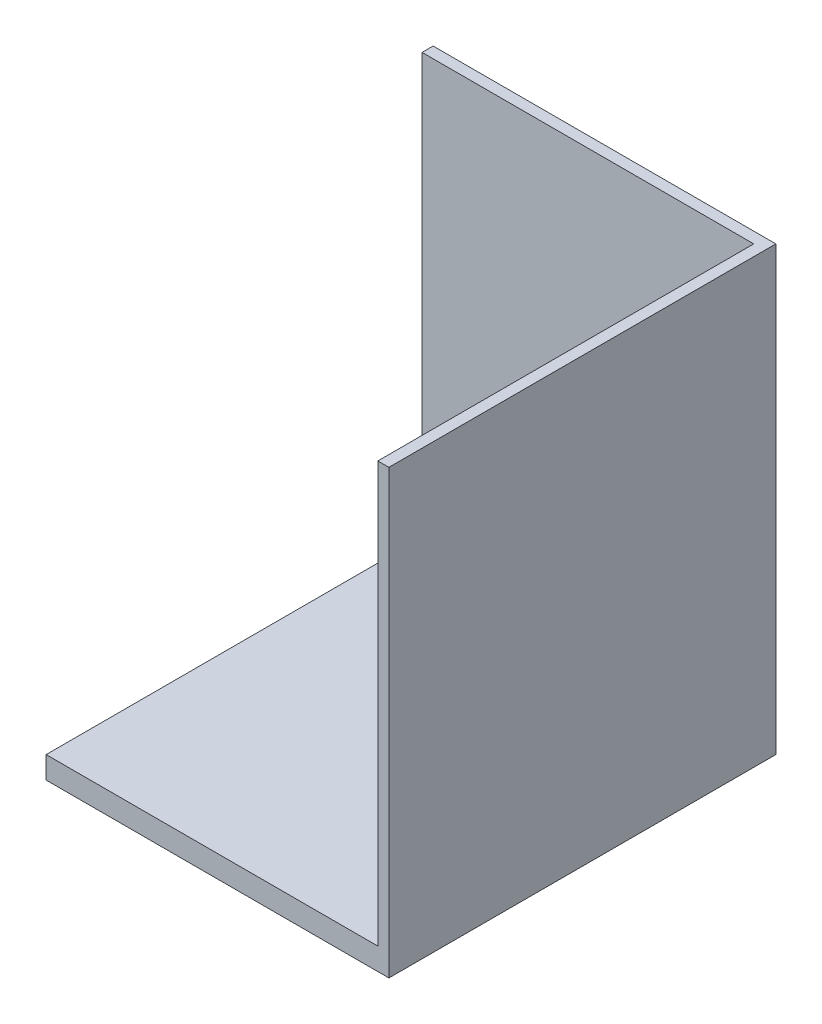
ISO-10303-21;
HEADER;
FILE_DESCRIPTION(('STEP AP214'),'2;1');
FILE_NAME('part.step','',(''),(''),'','','');
FILE_SCHEMA(('AUTOMOTIVE_DESIGN { 1 0 10303 214 1 1 1 1 }'));
ENDSEC;
DATA;
#1=APPLICATION_CONTEXT('core data for automotive mechanical design processes');
#2=APPLICATION_PROTOCOL_DEFINITION('international standard','automotive_design',2000,#1);
#3=PRODUCT_CONTEXT('',#1,'mechanical');
#4=PRODUCT('Part','Part','',(#3));
#5=PRODUCT_RELATED_PRODUCT_CATEGORY('part','',(#4));
#6=PRODUCT_DEFINITION_FORMATION('','',#4);
#7=PRODUCT_DEFINITION_CONTEXT('part definition',#1,'design');
#8=PRODUCT_DEFINITION('design','',#6,#7);
#9=PRODUCT_DEFINITION_SHAPE('','',#8);
#10=(LENGTH_UNIT() NAMED_UNIT(*) SI_UNIT(.MILLI.,.METRE.));
#11=(NAMED_UNIT(*) PLANE_ANGLE_UNIT() SI_UNIT($,.RADIAN.));
#12=(NAMED_UNIT(*) SI_UNIT($,.STERADIAN.) SOLID_ANGLE_UNIT());
#13=UNCERTAINTY_MEASURE_WITH_UNIT(LENGTH_MEASURE(1.E-05),#10,'distance_accuracy_value','');
#14=(GEOMETRIC_REPRESENTATION_CONTEXT(3) GLOBAL_UNCERTAINTY_ASSIGNED_CONTEXT((#13)) GLOBAL_UNIT_ASSIGNED_CONTEXT((#10,
#11,#12)) REPRESENTATION_CONTEXT('',''));
#15=CARTESIAN_POINT('',(0.,0.,0.));
#16=DIRECTION('',(0.,0.,1.));
#17=DIRECTION('',(1.,0.,0.));
#18=AXIS2_PLACEMENT_3D('',#15,#16,#17);
#19=CARTESIAN_POINT('',(65.2173913043479,-43.2608695652173,-200.));
#20=DIRECTION('',(0.,-1.,0.));
#21=DIRECTION('',(1.,0.,0.));
#22=AXIS2_PLACEMENT_3D('',#19,#20,#21);
#23=PLANE('',#22);
#24=DIRECTION('',(1.,0.,0.));
#25=VECTOR('',#24,1.);
#26=CARTESIAN_POINT('',(65.2173913043479,-43.2608695652173,-30.));
#27=LINE('',#26,#25);
#28=CARTESIAN_POINT('',(-84.7826086956521,-43.2608695652174,-30.));
#29=VERTEX_POINT('',#28);
#30=CARTESIAN_POINT('',(70.2173913043479,-43.2608695652173,-30.));
#31=VERTEX_POINT('',#30);
#32=EDGE_CURVE('E189',#29,#31,#27,.T.);
#33=ORIENTED_EDGE('',*,*,#32,.F.);
#34=DIRECTION('',(0.,0.,1.));
#35=VECTOR('',#34,1.);
#36=CARTESIAN_POINT('',(-84.7826086956521,-43.2608695652174,-200.));
#37=LINE('',#36,#35);
#38=CARTESIAN_POINT('',(-84.7826086956521,-43.2608695652174,-160.));
#39=VERTEX_POINT('',#38);
#40=EDGE_CURVE('E172',#39,#29,#37,.T.);
#41=ORIENTED_EDGE('',*,*,#40,.F.);
#42=DIRECTION('',(1.,0.,0.));
#43=VECTOR('',#42,1.);
#44=CARTESIAN_POINT('',(0.,-43.2608695652174,-160.));
#45=LINE('',#44,#43);
#46=CARTESIAN_POINT('',(25.2173913043479,-43.2608695652173,-160.));
#47=VERTEX_POINT('',#46);
#48=EDGE_CURVE('E188',#39,#47,#45,.T.);
#49=ORIENTED_EDGE('',*,*,#48,.T.);
#50=DIRECTION('',(0.,0.,1.));
#51=VECTOR('',#50,1.);
#52=CARTESIAN_POINT('',(25.2173913043479,-43.2608695652173,0.));
#53=LINE('',#52,#51);
#54=CARTESIAN_POINT('',(25.2173913043479,-43.2608695652173,-60.));
#55=VERTEX_POINT('',#54);
#56=EDGE_CURVE('E224',#47,#55,#53,.T.);
#57=ORIENTED_EDGE('',*,*,#56,.T.);
#58=DIRECTION('',(1.,0.,0.));
#59=VECTOR('',#58,1.);
#60=CARTESIAN_POINT('',(0.,-43.2608695652174,-60.));
#61=LINE('',#60,#59);
#62=CARTESIAN_POINT('',(35.2173913043479,-43.2608695652173,-60.));
#63=VERTEX_POINT('',#62);
#64=EDGE_CURVE('E221',#55,#63,#61,.T.);
#65=ORIENTED_EDGE('',*,*,#64,.T.);
#66=DIRECTION('',(0.,0.,-1.));
#67=VECTOR('',#66,1.);
#68=CARTESIAN_POINT('',(35.2173913043479,-43.2608695652173,0.));
#69=LINE('',#68,#67);
#70=CARTESIAN_POINT('',(35.2173913043479,-43.2608695652173,-170.));
#71=VERTEX_POINT('',#70);
#72=EDGE_CURVE('E195',#63,#71,#69,.T.);
#73=ORIENTED_EDGE('',*,*,#72,.T.);
#74=DIRECTION('',(-1.,0.,0.));
#75=VECTOR('',#74,1.);
#76=CARTESIAN_POINT('',(0.,-43.2608695652174,-170.));
#77=LINE('',#76,#75);
#78=CARTESIAN_POINT('',(-84.7826086956521,-43.2608695652174,-170.));
#79=VERTEX_POINT('',#78);
#80=EDGE_CURVE('E60',#71,#79,#77,.T.);
#81=ORIENTED_EDGE('',*,*,#80,.T.);
#82=CARTESIAN_POINT('',(-84.7826086956521,-43.2608695652173,-205.));
#83=VERTEX_POINT('',#82);
#84=EDGE_CURVE('E177',#83,#79,#37,.T.);
#85=ORIENTED_EDGE('',*,*,#84,.F.);
#86=DIRECTION('',(1.,0.,0.));
#87=VECTOR('',#86,1.);
#88=CARTESIAN_POINT('',(65.2173913043479,-43.2608695652173,-205.));
#89=LINE('',#88,#87);
#90=CARTESIAN_POINT('',(70.2173913043479,-43.2608695652173,-205.));
#91=VERTEX_POINT('',#90);
#92=EDGE_CURVE('E154',#83,#91,#89,.T.);
#93=ORIENTED_EDGE('',*,*,#92,.T.);
#94=DIRECTION('',(0.,0.,1.));
#95=VECTOR('',#94,1.);
#96=CARTESIAN_POINT('',(70.2173913043479,-43.2608695652173,-205.));
#97=LINE('',#96,#95);
#98=EDGE_CURVE('E166',#91,#31,#97,.T.);
#99=ORIENTED_EDGE('',*,*,#98,.T.);
#100=EDGE_LOOP('',(#33,#41,#49,#57,#65,#73,#81,#85,#93,#99));
#101=FACE_BOUND('',#100,.T.);
#102=ADVANCED_FACE('F38',(#101),#23,.T.);
#103=CARTESIAN_POINT('',(-84.7826086956521,-43.2608695652174,-200.));
#104=DIRECTION('',(-1.,0.,0.));
#105=DIRECTION('',(0.,0.,1.));
#106=AXIS2_PLACEMENT_3D('',#103,#104,#105);
#107=PLANE('',#106);
#108=DIRECTION('',(0.,-1.,0.));
#109=VECTOR('',#108,1.);
#110=CARTESIAN_POINT('',(-84.7826086956521,0.,-30.));
#111=LINE('',#110,#109);
#112=CARTESIAN_POINT('',(-84.7826086956521,-33.2608695652174,-30.));
#113=VERTEX_POINT('',#112);
#114=EDGE_CURVE('E149',#113,#29,#111,.T.);
#115=ORIENTED_EDGE('',*,*,#114,.F.);
#116=DIRECTION('',(0.,0.,1.));
#117=VECTOR('',#116,1.);
#118=CARTESIAN_POINT('',(-84.7826086956521,-33.2608695652174,-200.));
#119=LINE('',#118,#117);
#120=CARTESIAN_POINT('',(-84.7826086956521,-33.2608695652174,-200.));
#121=VERTEX_POINT('',#120);
#122=EDGE_CURVE('E46',#121,#113,#119,.T.);
#123=ORIENTED_EDGE('',*,*,#122,.F.);
#124=DIRECTION('',(0.,1.,0.));
#125=VECTOR('',#124,1.);
#126=CARTESIAN_POINT('',(-84.7826086956521,-43.2608695652173,-200.));
#127=LINE('',#126,#125);
#128=CARTESIAN_POINT('',(-84.7826086956521,156.739130434783,-200.));
#129=VERTEX_POINT('',#128);
#130=EDGE_CURVE('E148',#121,#129,#127,.T.);
#131=ORIENTED_EDGE('',*,*,#130,.T.);
#132=DIRECTION('',(0.,0.,1.));
#133=VECTOR('',#132,1.);
#134=CARTESIAN_POINT('',(-84.7826086956521,156.739130434783,0.));
#135=LINE('',#134,#133);
#136=CARTESIAN_POINT('',(-84.7826086956521,156.739130434783,-205.));
#137=VERTEX_POINT('',#136);
#138=EDGE_CURVE('E52',#137,#129,#135,.T.);
#139=ORIENTED_EDGE('',*,*,#138,.F.);
#140=DIRECTION('',(0.,-1.,0.));
#141=VECTOR('',#140,1.);
#142=CARTESIAN_POINT('',(-84.7826086956521,256.739130434783,-205.));
#143=LINE('',#142,#141);
#144=EDGE_CURVE('E145',#137,#83,#143,.T.);
#145=ORIENTED_EDGE('',*,*,#144,.T.);
#146=ORIENTED_EDGE('',*,*,#84,.T.);
#147=DIRECTION('',(0.,1.,0.));
#148=VECTOR('',#147,1.);
#149=CARTESIAN_POINT('',(-84.7826086956521,-73.2608695652174,-170.));
#150=LINE('',#149,#148);
#151=CARTESIAN_POINT('',(-84.7826086956521,-73.2608695652174,-170.));
#152=VERTEX_POINT('',#151);
#153=EDGE_CURVE('E217',#152,#79,#150,.T.);
#154=ORIENTED_EDGE('',*,*,#153,.F.);
#155=DIRECTION('',(0.,0.,-1.));
#156=VECTOR('',#155,1.);
#157=CARTESIAN_POINT('',(-84.7826086956521,-73.2608695652174,0.));
#158=LINE('',#157,#156);
#159=CARTESIAN_POINT('',(-84.7826086956521,-73.2608695652174,-160.));
#160=VERTEX_POINT('',#159);
#161=EDGE_CURVE('E216',#160,#152,#158,.T.);
#162=ORIENTED_EDGE('',*,*,#161,.F.);
#163=DIRECTION('',(0.,1.,0.));
#164=VECTOR('',#163,1.);
#165=CARTESIAN_POINT('',(-84.7826086956521,-73.2608695652174,-160.));
#166=LINE('',#165,#164);
#167=EDGE_CURVE('E182',#160,#39,#166,.T.);
#168=ORIENTED_EDGE('',*,*,#167,.T.);
#169=ORIENTED_EDGE('',*,*,#40,.T.);
#170=EDGE_LOOP('',(#115,#123,#131,#139,#145,#146,#154,#162,#168,#169));
#171=FACE_BOUND('',#170,.T.);
#172=ADVANCED_FACE('F40',(#171),#107,.T.);
#173=CARTESIAN_POINT('',(-84.7826086956521,-33.2608695652174,-200.));
#174=DIRECTION('',(0.,1.,0.));
#175=DIRECTION('',(0.,0.,1.));
#176=AXIS2_PLACEMENT_3D('',#173,#174,#175);
#177=PLANE('',#176);
#178=DIRECTION('',(-1.,0.,0.));
#179=VECTOR('',#178,1.);
#180=CARTESIAN_POINT('',(-84.7826086956521,-33.2608695652174,-30.));
#181=LINE('',#180,#179);
#182=CARTESIAN_POINT('',(65.2173913043479,-33.2608695652174,-30.));
#183=VERTEX_POINT('',#182);
#184=EDGE_CURVE('E193',#183,#113,#181,.T.);
#185=ORIENTED_EDGE('',*,*,#184,.F.);
#186=DIRECTION('',(0.,0.,1.));
#187=VECTOR('',#186,1.);
#188=CARTESIAN_POINT('',(65.2173913043479,-33.2608695652174,-200.));
#189=LINE('',#188,#187);
#190=CARTESIAN_POINT('',(65.2173913043479,-33.2608695652174,-200.));
#191=VERTEX_POINT('',#190);
#192=EDGE_CURVE('E175',#191,#183,#189,.T.);
#193=ORIENTED_EDGE('',*,*,#192,.F.);
#194=DIRECTION('',(-1.,0.,0.));
#195=VECTOR('',#194,1.);
#196=CARTESIAN_POINT('',(-84.7826086956521,-33.2608695652174,-200.));
#197=LINE('',#196,#195);
#198=EDGE_CURVE('E169',#191,#121,#197,.T.);
#199=ORIENTED_EDGE('',*,*,#198,.T.);
#200=ORIENTED_EDGE('',*,*,#122,.T.);
#201=EDGE_LOOP('',(#185,#193,#199,#200));
#202=FACE_BOUND('',#201,.T.);
#203=ADVANCED_FACE('F265',(#202),#177,.T.);
#204=CARTESIAN_POINT('',(65.2173913043479,256.739130434783,-205.));
#205=DIRECTION('',(-1.,0.,0.));
#206=DIRECTION('',(0.,0.,1.));
#207=AXIS2_PLACEMENT_3D('',#204,#205,#206);
#208=PLANE('',#207);
#209=DIRECTION('',(0.,-1.,0.));
#210=VECTOR('',#209,1.);
#211=CARTESIAN_POINT('',(65.2173913043479,256.739130434783,-30.));
#212=LINE('',#211,#210);
#213=CARTESIAN_POINT('',(65.2173913043479,156.739130434783,-30.));
#214=VERTEX_POINT('',#213);
#215=EDGE_CURVE('E197',#214,#183,#212,.T.);
#216=ORIENTED_EDGE('',*,*,#215,.F.);
#217=DIRECTION('',(0.,0.,1.));
#218=VECTOR('',#217,1.);
#219=CARTESIAN_POINT('',(65.2173913043479,156.739130434783,-205.));
#220=LINE('',#219,#218);
#221=CARTESIAN_POINT('',(65.2173913043479,156.739130434783,-200.));
#222=VERTEX_POINT('',#221);
#223=EDGE_CURVE('E406',#222,#214,#220,.T.);
#224=ORIENTED_EDGE('',*,*,#223,.F.);
#225=DIRECTION('',(0.,1.,0.));
#226=VECTOR('',#225,1.);
#227=CARTESIAN_POINT('',(65.2173913043479,-43.2608695652173,-200.));
#228=LINE('',#227,#226);
#229=EDGE_CURVE('E157',#191,#222,#228,.T.);
#230=ORIENTED_EDGE('',*,*,#229,.F.);
#231=ORIENTED_EDGE('',*,*,#192,.T.);
#232=EDGE_LOOP('',(#216,#224,#230,#231));
#233=FACE_BOUND('',#232,.T.);
#234=ADVANCED_FACE('F269',(#233),#208,.T.);
#235=CARTESIAN_POINT('',(70.2173913043479,-43.2608695652173,-205.));
#236=DIRECTION('',(1.,0.,0.));
#237=DIRECTION('',(0.,1.,0.));
#238=AXIS2_PLACEMENT_3D('',#235,#236,#237);
#239=PLANE('',#238);
#240=DIRECTION('',(0.,-1.,0.));
#241=VECTOR('',#240,1.);
#242=CARTESIAN_POINT('',(70.2173913043479,0.,-30.));
#243=LINE('',#242,#241);
#244=CARTESIAN_POINT('',(70.2173913043479,156.739130434783,-30.));
#245=VERTEX_POINT('',#244);
#246=EDGE_CURVE('E139',#245,#31,#243,.T.);
#247=ORIENTED_EDGE('',*,*,#246,.T.);
#248=ORIENTED_EDGE('',*,*,#98,.F.);
#249=DIRECTION('',(0.,1.,0.));
#250=VECTOR('',#249,1.);
#251=CARTESIAN_POINT('',(70.2173913043479,-43.2608695652173,-205.));
#252=LINE('',#251,#250);
#253=CARTESIAN_POINT('',(70.2173913043479,156.739130434783,-205.));
#254=VERTEX_POINT('',#253);
#255=EDGE_CURVE('E164',#91,#254,#252,.T.);
#256=ORIENTED_EDGE('',*,*,#255,.T.);
#257=DIRECTION('',(0.,0.,1.));
#258=VECTOR('',#257,1.);
#259=CARTESIAN_POINT('',(70.2173913043479,156.739130434783,0.));
#260=LINE('',#259,#258);
#261=EDGE_CURVE('E133',#254,#245,#260,.T.);
#262=ORIENTED_EDGE('',*,*,#261,.T.);
#263=EDGE_LOOP('',(#247,#248,#256,#262));
#264=FACE_BOUND('',#263,.T.);
#265=ADVANCED_FACE('F271',(#264),#239,.T.);
#266=CARTESIAN_POINT('',(0.,0.,-205.));
#267=DIRECTION('',(0.,0.,1.));
#268=DIRECTION('',(1.,0.,0.));
#269=AXIS2_PLACEMENT_3D('',#266,#267,#268);
#270=PLANE('',#269);
#271=ORIENTED_EDGE('',*,*,#144,.F.);
#272=DIRECTION('',(-1.,0.,0.));
#273=VECTOR('',#272,1.);
#274=CARTESIAN_POINT('',(70.2173913043479,156.739130434783,-205.));
#275=LINE('',#274,#273);
#276=EDGE_CURVE('E130',#254,#137,#275,.T.);
#277=ORIENTED_EDGE('',*,*,#276,.F.);
#278=ORIENTED_EDGE('',*,*,#255,.F.);
#279=ORIENTED_EDGE('',*,*,#92,.F.);
#280=EDGE_LOOP('',(#271,#277,#278,#279));
#281=FACE_BOUND('',#280,.T.);
#282=ADVANCED_FACE('F152',(#281),#270,.F.);
#283=CARTESIAN_POINT('',(65.2173913043479,-43.2608695652173,-200.));
#284=DIRECTION('',(0.,0.,1.));
#285=DIRECTION('',(1.,0.,0.));
#286=AXIS2_PLACEMENT_3D('',#283,#284,#285);
#287=PLANE('',#286);
#288=DIRECTION('',(1.,0.,0.));
#289=VECTOR('',#288,1.);
#290=CARTESIAN_POINT('',(65.2173913043479,156.739130434783,-200.));
#291=LINE('',#290,#289);
#292=EDGE_CURVE('E11',#129,#222,#291,.T.);
#293=ORIENTED_EDGE('',*,*,#292,.F.);
#294=ORIENTED_EDGE('',*,*,#130,.F.);
#295=ORIENTED_EDGE('',*,*,#198,.F.);
#296=ORIENTED_EDGE('',*,*,#229,.T.);
#297=EDGE_LOOP('',(#293,#294,#295,#296));
#298=FACE_BOUND('',#297,.T.);
#299=ADVANCED_FACE('F280',(#298),#287,.T.);
#300=CARTESIAN_POINT('',(0.,-73.2608695652173,-170.));
#301=DIRECTION('',(0.,0.,-1.));
#302=DIRECTION('',(-1.,0.,0.));
#303=AXIS2_PLACEMENT_3D('',#300,#301,#302);
#304=PLANE('',#303);
#305=ORIENTED_EDGE('',*,*,#80,.F.);
#306=DIRECTION('',(0.,1.,0.));
#307=VECTOR('',#306,1.);
#308=CARTESIAN_POINT('',(35.2173913043479,-73.2608695652173,-170.));
#309=LINE('',#308,#307);
#310=CARTESIAN_POINT('',(35.2173913043479,-73.2608695652173,-170.));
#311=VERTEX_POINT('',#310);
#312=EDGE_CURVE('E155',#311,#71,#309,.T.);
#313=ORIENTED_EDGE('',*,*,#312,.F.);
#314=DIRECTION('',(-1.,0.,0.));
#315=VECTOR('',#314,1.);
#316=CARTESIAN_POINT('',(0.,-73.2608695652173,-170.));
#317=LINE('',#316,#315);
#318=EDGE_CURVE('E201',#311,#152,#317,.T.);
#319=ORIENTED_EDGE('',*,*,#318,.T.);
#320=ORIENTED_EDGE('',*,*,#153,.T.);
#321=EDGE_LOOP('',(#305,#313,#319,#320));
#322=FACE_BOUND('',#321,.T.);
#323=ADVANCED_FACE('F249',(#322),#304,.T.);
#324=CARTESIAN_POINT('',(35.2173913043479,-73.2608695652173,0.));
#325=DIRECTION('',(1.,0.,0.));
#326=DIRECTION('',(0.,1.,0.));
#327=AXIS2_PLACEMENT_3D('',#324,#325,#326);
#328=PLANE('',#327);
#329=ORIENTED_EDGE('',*,*,#72,.F.);
#330=DIRECTION('',(0.,1.,0.));
#331=VECTOR('',#330,1.);
#332=CARTESIAN_POINT('',(35.2173913043479,-73.2608695652173,-60.));
#333=LINE('',#332,#331);
#334=CARTESIAN_POINT('',(35.2173913043479,-73.2608695652173,-60.));
#335=VERTEX_POINT('',#334);
#336=EDGE_CURVE('E159',#335,#63,#333,.T.);
#337=ORIENTED_EDGE('',*,*,#336,.F.);
#338=DIRECTION('',(0.,0.,-1.));
#339=VECTOR('',#338,1.);
#340=CARTESIAN_POINT('',(35.2173913043479,-73.2608695652173,0.));
#341=LINE('',#340,#339);
#342=EDGE_CURVE('E204',#335,#311,#341,.T.);
#343=ORIENTED_EDGE('',*,*,#342,.T.);
#344=ORIENTED_EDGE('',*,*,#312,.T.);
#345=EDGE_LOOP('',(#329,#337,#343,#344));
#346=FACE_BOUND('',#345,.T.);
#347=ADVANCED_FACE('F240',(#346),#328,.T.);
#348=CARTESIAN_POINT('',(0.,-73.2608695652173,-60.));
#349=DIRECTION('',(0.,0.,1.));
#350=DIRECTION('',(1.,0.,0.));
#351=AXIS2_PLACEMENT_3D('',#348,#349,#350);
#352=PLANE('',#351);
#353=ORIENTED_EDGE('',*,*,#64,.F.);
#354=DIRECTION('',(0.,1.,0.));
#355=VECTOR('',#354,1.);
#356=CARTESIAN_POINT('',(25.2173913043479,-73.2608695652173,-60.));
#357=LINE('',#356,#355);
#358=CARTESIAN_POINT('',(25.2173913043479,-73.2608695652173,-60.));
#359=VERTEX_POINT('',#358);
#360=EDGE_CURVE('E231',#359,#55,#357,.T.);
#361=ORIENTED_EDGE('',*,*,#360,.F.);
#362=DIRECTION('',(1.,0.,0.));
#363=VECTOR('',#362,1.);
#364=CARTESIAN_POINT('',(0.,-73.2608695652173,-60.));
#365=LINE('',#364,#363);
#366=EDGE_CURVE('E207',#359,#335,#365,.T.);
#367=ORIENTED_EDGE('',*,*,#366,.T.);
#368=ORIENTED_EDGE('',*,*,#336,.T.);
#369=EDGE_LOOP('',(#353,#361,#367,#368));
#370=FACE_BOUND('',#369,.T.);
#371=ADVANCED_FACE('F236',(#370),#352,.T.);
#372=CARTESIAN_POINT('',(25.2173913043479,-73.2608695652173,0.));
#373=DIRECTION('',(-1.,0.,0.));
#374=DIRECTION('',(0.,-1.,0.));
#375=AXIS2_PLACEMENT_3D('',#372,#373,#374);
#376=PLANE('',#375);
#377=ORIENTED_EDGE('',*,*,#56,.F.);
#378=DIRECTION('',(0.,1.,0.));
#379=VECTOR('',#378,1.);
#380=CARTESIAN_POINT('',(25.2173913043479,-73.2608695652173,-160.));
#381=LINE('',#380,#379);
#382=CARTESIAN_POINT('',(25.2173913043479,-73.2608695652173,-160.));
#383=VERTEX_POINT('',#382);
#384=EDGE_CURVE('E229',#383,#47,#381,.T.);
#385=ORIENTED_EDGE('',*,*,#384,.F.);
#386=DIRECTION('',(0.,0.,1.));
#387=VECTOR('',#386,1.);
#388=CARTESIAN_POINT('',(25.2173913043479,-73.2608695652173,0.));
#389=LINE('',#388,#387);
#390=EDGE_CURVE('E210',#383,#359,#389,.T.);
#391=ORIENTED_EDGE('',*,*,#390,.T.);
#392=ORIENTED_EDGE('',*,*,#360,.T.);
#393=EDGE_LOOP('',(#377,#385,#391,#392));
#394=FACE_BOUND('',#393,.T.);
#395=ADVANCED_FACE('F243',(#394),#376,.T.);
#396=CARTESIAN_POINT('',(0.,-73.2608695652173,-160.));
#397=DIRECTION('',(0.,0.,1.));
#398=DIRECTION('',(1.,0.,0.));
#399=AXIS2_PLACEMENT_3D('',#396,#397,#398);
#400=PLANE('',#399);
#401=ORIENTED_EDGE('',*,*,#48,.F.);
#402=ORIENTED_EDGE('',*,*,#167,.F.);
#403=DIRECTION('',(1.,0.,0.));
#404=VECTOR('',#403,1.);
#405=CARTESIAN_POINT('',(0.,-73.2608695652173,-160.));
#406=LINE('',#405,#404);
#407=EDGE_CURVE('E213',#160,#383,#406,.T.);
#408=ORIENTED_EDGE('',*,*,#407,.T.);
#409=ORIENTED_EDGE('',*,*,#384,.T.);
#410=EDGE_LOOP('',(#401,#402,#408,#409));
#411=FACE_BOUND('',#410,.T.);
#412=ADVANCED_FACE('F251',(#411),#400,.T.);
#413=CARTESIAN_POINT('',(0.,-73.2608695652173,0.));
#414=DIRECTION('',(0.,-1.,0.));
#415=DIRECTION('',(1.,0.,0.));
#416=AXIS2_PLACEMENT_3D('',#413,#414,#415);
#417=PLANE('',#416);
#418=ORIENTED_EDGE('',*,*,#318,.F.);
#419=ORIENTED_EDGE('',*,*,#342,.F.);
#420=ORIENTED_EDGE('',*,*,#366,.F.);
#421=ORIENTED_EDGE('',*,*,#390,.F.);
#422=ORIENTED_EDGE('',*,*,#407,.F.);
#423=ORIENTED_EDGE('',*,*,#161,.T.);
#424=EDGE_LOOP('',(#418,#419,#420,#421,#422,#423));
#425=FACE_BOUND('',#424,.T.);
#426=ADVANCED_FACE('F247',(#425),#417,.T.);
#427=CARTESIAN_POINT('',(70.2173913043479,0.,-30.));
#428=DIRECTION('',(0.,0.,-1.));
#429=DIRECTION('',(0.,1.,0.));
#430=AXIS2_PLACEMENT_3D('',#427,#428,#429);
#431=PLANE('',#430);
#432=ORIENTED_EDGE('',*,*,#32,.T.);
#433=ORIENTED_EDGE('',*,*,#246,.F.);
#434=DIRECTION('',(-1.,0.,0.));
#435=VECTOR('',#434,1.);
#436=CARTESIAN_POINT('',(70.2173913043479,156.739130434783,-30.));
#437=LINE('',#436,#435);
#438=EDGE_CURVE('E138',#245,#214,#437,.T.);
#439=ORIENTED_EDGE('',*,*,#438,.T.);
#440=ORIENTED_EDGE('',*,*,#215,.T.);
#441=ORIENTED_EDGE('',*,*,#184,.T.);
#442=ORIENTED_EDGE('',*,*,#114,.T.);
#443=EDGE_LOOP('',(#432,#433,#439,#440,#441,#442));
#444=FACE_BOUND('',#443,.T.);
#445=ADVANCED_FACE('F258',(#444),#431,.F.);
#446=CARTESIAN_POINT('',(70.2173913043479,156.739130434783,0.));
#447=DIRECTION('',(0.,-1.,0.));
#448=DIRECTION('',(0.,0.,-1.));
#449=AXIS2_PLACEMENT_3D('',#446,#447,#448);
#450=PLANE('',#449);
#451=ORIENTED_EDGE('',*,*,#223,.T.);
#452=ORIENTED_EDGE('',*,*,#438,.F.);
#453=ORIENTED_EDGE('',*,*,#261,.F.);
#454=ORIENTED_EDGE('',*,*,#276,.T.);
#455=ORIENTED_EDGE('',*,*,#138,.T.);
#456=ORIENTED_EDGE('',*,*,#292,.T.);
#457=EDGE_LOOP('',(#451,#452,#453,#454,#455,#456));
#458=FACE_BOUND('',#457,.T.);
#459=ADVANCED_FACE('F131',(#458),#450,.F.);
#460=CLOSED_SHELL('',(#102,#172,#203,#234,#265,#282,#299,#323,#347,#371,#395,#412,#426,#445,#459));
#461=MANIFOLD_SOLID_BREP('B2',#460);
#462=ADVANCED_BREP_SHAPE_REPRESENTATION('',(#18,#461),#14);
#463=SHAPE_DEFINITION_REPRESENTATION(#9,#462);
ENDSEC;
END-ISO-10303-21;
